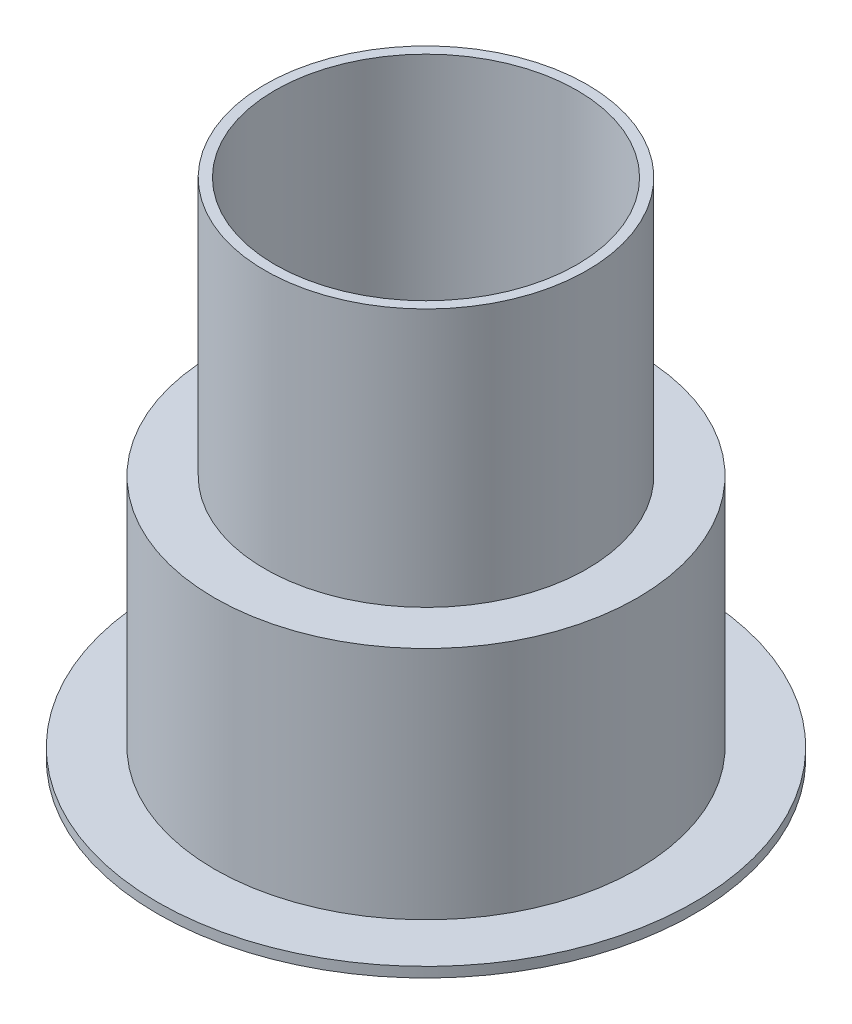
ISO-10303-21;
HEADER;
FILE_DESCRIPTION(('STEP AP214'),'2;1');
FILE_NAME('part.step','',(''),(''),'','','');
FILE_SCHEMA(('AUTOMOTIVE_DESIGN { 1 0 10303 214 1 1 1 1 }'));
ENDSEC;
DATA;
#1=APPLICATION_CONTEXT('core data for automotive mechanical design processes');
#2=APPLICATION_PROTOCOL_DEFINITION('international standard','automotive_design',2000,#1);
#3=PRODUCT_CONTEXT('',#1,'mechanical');
#4=PRODUCT('Part','Part','',(#3));
#5=PRODUCT_RELATED_PRODUCT_CATEGORY('part','',(#4));
#6=PRODUCT_DEFINITION_FORMATION('','',#4);
#7=PRODUCT_DEFINITION_CONTEXT('part definition',#1,'design');
#8=PRODUCT_DEFINITION('design','',#6,#7);
#9=PRODUCT_DEFINITION_SHAPE('','',#8);
#10=(LENGTH_UNIT() NAMED_UNIT(*) SI_UNIT(.MILLI.,.METRE.));
#11=(NAMED_UNIT(*) PLANE_ANGLE_UNIT() SI_UNIT($,.RADIAN.));
#12=(NAMED_UNIT(*) SI_UNIT($,.STERADIAN.) SOLID_ANGLE_UNIT());
#13=UNCERTAINTY_MEASURE_WITH_UNIT(LENGTH_MEASURE(1.E-05),#10,'distance_accuracy_value','');
#14=(GEOMETRIC_REPRESENTATION_CONTEXT(3) GLOBAL_UNCERTAINTY_ASSIGNED_CONTEXT((#13)) GLOBAL_UNIT_ASSIGNED_CONTEXT((#10,
#11,#12)) REPRESENTATION_CONTEXT('',''));
#15=CARTESIAN_POINT('',(0.,0.,0.));
#16=DIRECTION('',(0.,0.,1.));
#17=DIRECTION('',(1.,0.,0.));
#18=AXIS2_PLACEMENT_3D('',#15,#16,#17);
#19=CARTESIAN_POINT('',(6.,-0.854835863287098,0.));
#20=DIRECTION('',(0.,-1.,0.));
#21=DIRECTION('',(0.,0.,-1.));
#22=AXIS2_PLACEMENT_3D('',#19,#20,#21);
#23=PLANE('',#22);
#24=CARTESIAN_POINT('',(0.,-0.854835863287098,0.));
#25=DIRECTION('',(0.,-1.,0.));
#26=DIRECTION('',(0.,0.,-1.));
#27=AXIS2_PLACEMENT_3D('',#24,#25,#26);
#28=CIRCLE('',#27,8.);
#29=CARTESIAN_POINT('',(0.,-0.854835863287098,-8.));
#30=VERTEX_POINT('',#29);
#31=EDGE_CURVE('E10',#30,#30,#28,.T.);
#32=ORIENTED_EDGE('',*,*,#31,.T.);
#33=EDGE_LOOP('',(#32));
#34=FACE_BOUND('',#33,.T.);
#35=CARTESIAN_POINT('',(0.,-0.854835863287098,0.));
#36=DIRECTION('',(0.,-1.,0.));
#37=DIRECTION('',(0.,0.,-1.));
#38=AXIS2_PLACEMENT_3D('',#35,#36,#37);
#39=CIRCLE('',#38,6.);
#40=CARTESIAN_POINT('',(0.,-0.854835863287098,-6.));
#41=VERTEX_POINT('',#40);
#42=EDGE_CURVE('E71',#41,#41,#39,.T.);
#43=ORIENTED_EDGE('',*,*,#42,.F.);
#44=EDGE_LOOP('',(#43));
#45=FACE_BOUND('',#44,.T.);
#46=ADVANCED_FACE('F37',(#34,#45),#23,.T.);
#47=CARTESIAN_POINT('',(0.,0.,0.));
#48=DIRECTION('',(0.,-1.,0.));
#49=DIRECTION('',(0.,0.,-1.));
#50=AXIS2_PLACEMENT_3D('',#47,#48,#49);
#51=CYLINDRICAL_SURFACE('',#50,8.);
#52=CARTESIAN_POINT('',(0.,-0.554835863287098,0.));
#53=DIRECTION('',(0.,-1.,0.));
#54=DIRECTION('',(0.,0.,-1.));
#55=AXIS2_PLACEMENT_3D('',#52,#53,#54);
#56=CIRCLE('',#55,8.);
#57=CARTESIAN_POINT('',(0.,-0.554835863287098,-8.));
#58=VERTEX_POINT('',#57);
#59=EDGE_CURVE('E43',#58,#58,#56,.T.);
#60=ORIENTED_EDGE('',*,*,#59,.T.);
#61=EDGE_LOOP('',(#60));
#62=FACE_BOUND('',#61,.T.);
#63=ORIENTED_EDGE('',*,*,#31,.F.);
#64=EDGE_LOOP('',(#63));
#65=FACE_BOUND('',#64,.T.);
#66=ADVANCED_FACE('F79',(#62,#65),#51,.T.);
#67=CARTESIAN_POINT('',(6.3,-0.554835863287098,0.));
#68=DIRECTION('',(0.,1.,0.));
#69=DIRECTION('',(0.,0.,1.));
#70=AXIS2_PLACEMENT_3D('',#67,#68,#69);
#71=PLANE('',#70);
#72=CARTESIAN_POINT('',(0.,-0.554835863287098,0.));
#73=DIRECTION('',(0.,-1.,0.));
#74=DIRECTION('',(0.,0.,-1.));
#75=AXIS2_PLACEMENT_3D('',#72,#73,#74);
#76=CIRCLE('',#75,6.3);
#77=CARTESIAN_POINT('',(0.,-0.554835863287098,-6.3));
#78=VERTEX_POINT('',#77);
#79=EDGE_CURVE('E47',#78,#78,#76,.T.);
#80=ORIENTED_EDGE('',*,*,#79,.T.);
#81=EDGE_LOOP('',(#80));
#82=FACE_BOUND('',#81,.T.);
#83=ORIENTED_EDGE('',*,*,#59,.F.);
#84=EDGE_LOOP('',(#83));
#85=FACE_BOUND('',#84,.T.);
#86=ADVANCED_FACE('F83',(#82,#85),#71,.T.);
#87=CARTESIAN_POINT('',(0.,0.,0.));
#88=DIRECTION('',(0.,-1.,0.));
#89=DIRECTION('',(0.,0.,-1.));
#90=AXIS2_PLACEMENT_3D('',#87,#88,#89);
#91=CYLINDRICAL_SURFACE('',#90,6.3);
#92=CARTESIAN_POINT('',(0.,6.4451641367129,0.));
#93=DIRECTION('',(0.,-1.,0.));
#94=DIRECTION('',(0.,0.,-1.));
#95=AXIS2_PLACEMENT_3D('',#92,#93,#94);
#96=CIRCLE('',#95,6.3);
#97=CARTESIAN_POINT('',(0.,6.4451641367129,-6.3));
#98=VERTEX_POINT('',#97);
#99=EDGE_CURVE('E51',#98,#98,#96,.T.);
#100=ORIENTED_EDGE('',*,*,#99,.T.);
#101=EDGE_LOOP('',(#100));
#102=FACE_BOUND('',#101,.T.);
#103=ORIENTED_EDGE('',*,*,#79,.F.);
#104=EDGE_LOOP('',(#103));
#105=FACE_BOUND('',#104,.T.);
#106=ADVANCED_FACE('F87',(#102,#105),#91,.T.);
#107=CARTESIAN_POINT('',(6.3,6.4451641367129,0.));
#108=DIRECTION('',(0.,1.,0.));
#109=DIRECTION('',(0.,0.,1.));
#110=AXIS2_PLACEMENT_3D('',#107,#108,#109);
#111=PLANE('',#110);
#112=CARTESIAN_POINT('',(0.,6.4451641367129,0.));
#113=DIRECTION('',(0.,-1.,0.));
#114=DIRECTION('',(0.,0.,-1.));
#115=AXIS2_PLACEMENT_3D('',#112,#113,#114);
#116=CIRCLE('',#115,4.8);
#117=CARTESIAN_POINT('',(0.,6.4451641367129,-4.8));
#118=VERTEX_POINT('',#117);
#119=EDGE_CURVE('E56',#118,#118,#116,.T.);
#120=ORIENTED_EDGE('',*,*,#119,.T.);
#121=EDGE_LOOP('',(#120));
#122=FACE_BOUND('',#121,.T.);
#123=ORIENTED_EDGE('',*,*,#99,.F.);
#124=EDGE_LOOP('',(#123));
#125=FACE_BOUND('',#124,.T.);
#126=ADVANCED_FACE('F94',(#122,#125),#111,.T.);
#127=CARTESIAN_POINT('',(0.,0.,0.));
#128=DIRECTION('',(0.,-1.,0.));
#129=DIRECTION('',(0.,0.,-1.));
#130=AXIS2_PLACEMENT_3D('',#127,#128,#129);
#131=CYLINDRICAL_SURFACE('',#130,4.8);
#132=CARTESIAN_POINT('',(0.,14.1451641367129,0.));
#133=DIRECTION('',(0.,-1.,0.));
#134=DIRECTION('',(0.,0.,-1.));
#135=AXIS2_PLACEMENT_3D('',#132,#133,#134);
#136=CIRCLE('',#135,4.8);
#137=CARTESIAN_POINT('',(0.,14.1451641367129,-4.8));
#138=VERTEX_POINT('',#137);
#139=EDGE_CURVE('E59',#138,#138,#136,.T.);
#140=ORIENTED_EDGE('',*,*,#139,.T.);
#141=EDGE_LOOP('',(#140));
#142=FACE_BOUND('',#141,.T.);
#143=ORIENTED_EDGE('',*,*,#119,.F.);
#144=EDGE_LOOP('',(#143));
#145=FACE_BOUND('',#144,.T.);
#146=ADVANCED_FACE('F98',(#142,#145),#131,.T.);
#147=CARTESIAN_POINT('',(4.5,14.1451641367129,0.));
#148=DIRECTION('',(0.,1.,0.));
#149=DIRECTION('',(0.,0.,1.));
#150=AXIS2_PLACEMENT_3D('',#147,#148,#149);
#151=PLANE('',#150);
#152=CARTESIAN_POINT('',(0.,14.1451641367129,0.));
#153=DIRECTION('',(0.,-1.,0.));
#154=DIRECTION('',(0.,0.,-1.));
#155=AXIS2_PLACEMENT_3D('',#152,#153,#154);
#156=CIRCLE('',#155,4.5);
#157=CARTESIAN_POINT('',(0.,14.1451641367129,-4.5));
#158=VERTEX_POINT('',#157);
#159=EDGE_CURVE('E62',#158,#158,#156,.T.);
#160=ORIENTED_EDGE('',*,*,#159,.T.);
#161=EDGE_LOOP('',(#160));
#162=FACE_BOUND('',#161,.T.);
#163=ORIENTED_EDGE('',*,*,#139,.F.);
#164=EDGE_LOOP('',(#163));
#165=FACE_BOUND('',#164,.T.);
#166=ADVANCED_FACE('F102',(#162,#165),#151,.T.);
#167=CARTESIAN_POINT('',(0.,0.,0.));
#168=DIRECTION('',(0.,-1.,0.));
#169=DIRECTION('',(0.,0.,-1.));
#170=AXIS2_PLACEMENT_3D('',#167,#168,#169);
#171=CYLINDRICAL_SURFACE('',#170,4.5);
#172=CARTESIAN_POINT('',(0.,6.4451641367129,0.));
#173=DIRECTION('',(0.,-1.,0.));
#174=DIRECTION('',(0.,0.,-1.));
#175=AXIS2_PLACEMENT_3D('',#172,#173,#174);
#176=CIRCLE('',#175,4.5);
#177=CARTESIAN_POINT('',(0.,6.4451641367129,-4.5));
#178=VERTEX_POINT('',#177);
#179=EDGE_CURVE('E65',#178,#178,#176,.T.);
#180=ORIENTED_EDGE('',*,*,#179,.T.);
#181=EDGE_LOOP('',(#180));
#182=FACE_BOUND('',#181,.T.);
#183=ORIENTED_EDGE('',*,*,#159,.F.);
#184=EDGE_LOOP('',(#183));
#185=FACE_BOUND('',#184,.T.);
#186=ADVANCED_FACE('F106',(#182,#185),#171,.F.);
#187=CARTESIAN_POINT('',(4.5,6.4451641367129,0.));
#188=DIRECTION('',(0.,1.,0.));
#189=DIRECTION('',(0.,0.,1.));
#190=AXIS2_PLACEMENT_3D('',#187,#188,#189);
#191=PLANE('',#190);
#192=ORIENTED_EDGE('',*,*,#179,.F.);
#193=EDGE_LOOP('',(#192));
#194=FACE_BOUND('',#193,.T.);
#195=ADVANCED_FACE('F110',(#194),#191,.T.);
#196=CARTESIAN_POINT('',(6.,6.1451641367129,0.));
#197=DIRECTION('',(0.,-1.,0.));
#198=DIRECTION('',(0.,0.,-1.));
#199=AXIS2_PLACEMENT_3D('',#196,#197,#198);
#200=PLANE('',#199);
#201=CARTESIAN_POINT('',(0.,6.1451641367129,0.));
#202=DIRECTION('',(0.,-1.,0.));
#203=DIRECTION('',(0.,0.,-1.));
#204=AXIS2_PLACEMENT_3D('',#201,#202,#203);
#205=CIRCLE('',#204,6.);
#206=CARTESIAN_POINT('',(0.,6.1451641367129,-6.));
#207=VERTEX_POINT('',#206);
#208=EDGE_CURVE('E68',#207,#207,#205,.T.);
#209=ORIENTED_EDGE('',*,*,#208,.T.);
#210=EDGE_LOOP('',(#209));
#211=FACE_BOUND('',#210,.T.);
#212=ADVANCED_FACE('F114',(#211),#200,.T.);
#213=CARTESIAN_POINT('',(0.,0.,0.));
#214=DIRECTION('',(0.,-1.,0.));
#215=DIRECTION('',(0.,0.,-1.));
#216=AXIS2_PLACEMENT_3D('',#213,#214,#215);
#217=CYLINDRICAL_SURFACE('',#216,6.);
#218=ORIENTED_EDGE('',*,*,#42,.T.);
#219=EDGE_LOOP('',(#218));
#220=FACE_BOUND('',#219,.T.);
#221=ORIENTED_EDGE('',*,*,#208,.F.);
#222=EDGE_LOOP('',(#221));
#223=FACE_BOUND('',#222,.T.);
#224=ADVANCED_FACE('F75',(#220,#223),#217,.F.);
#225=CLOSED_SHELL('',(#46,#66,#86,#106,#126,#146,#166,#186,#195,#212,#224));
#226=MANIFOLD_SOLID_BREP('B2',#225);
#227=ADVANCED_BREP_SHAPE_REPRESENTATION('',(#18,#226),#14);
#228=SHAPE_DEFINITION_REPRESENTATION(#9,#227);
ENDSEC;
END-ISO-10303-21;
